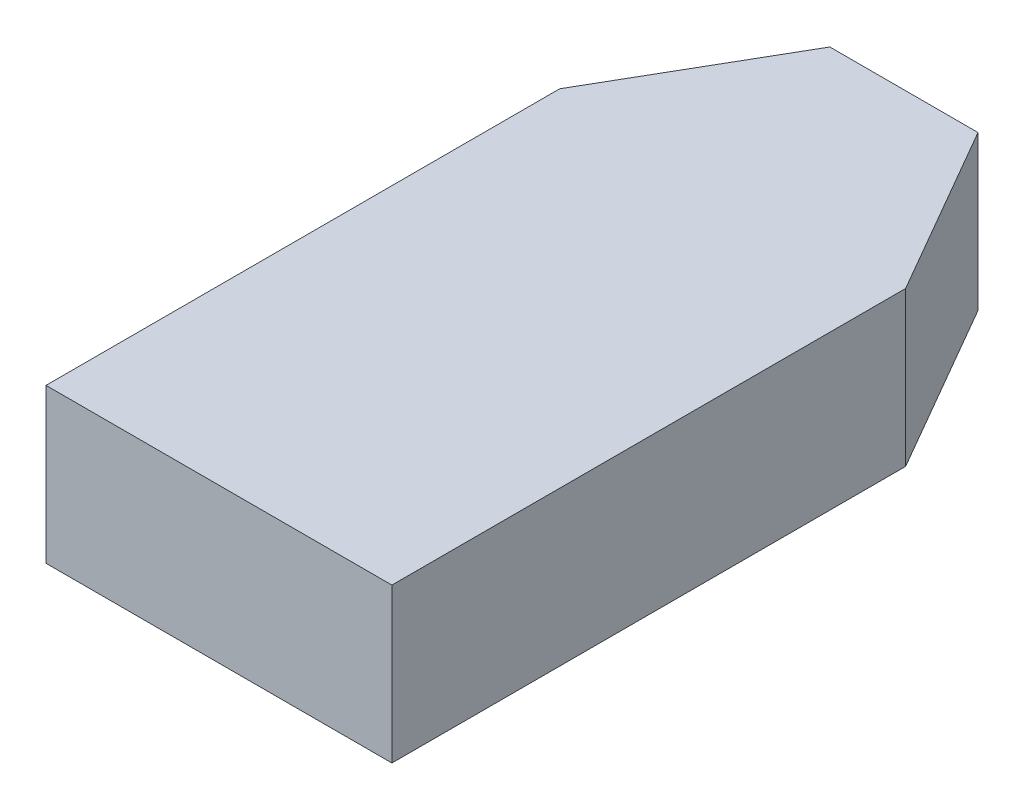
ISO-10303-21;
HEADER;
FILE_DESCRIPTION(('STEP AP214'),'2;1');
FILE_NAME('part.step','',(''),(''),'','','');
FILE_SCHEMA(('AUTOMOTIVE_DESIGN { 1 0 10303 214 1 1 1 1 }'));
ENDSEC;
DATA;
#1=APPLICATION_CONTEXT('core data for automotive mechanical design processes');
#2=APPLICATION_PROTOCOL_DEFINITION('international standard','automotive_design',2000,#1);
#3=PRODUCT_CONTEXT('',#1,'mechanical');
#4=PRODUCT('Part','Part','',(#3));
#5=PRODUCT_RELATED_PRODUCT_CATEGORY('part','',(#4));
#6=PRODUCT_DEFINITION_FORMATION('','',#4);
#7=PRODUCT_DEFINITION_CONTEXT('part definition',#1,'design');
#8=PRODUCT_DEFINITION('design','',#6,#7);
#9=PRODUCT_DEFINITION_SHAPE('','',#8);
#10=(LENGTH_UNIT() NAMED_UNIT(*) SI_UNIT(.MILLI.,.METRE.));
#11=(NAMED_UNIT(*) PLANE_ANGLE_UNIT() SI_UNIT($,.RADIAN.));
#12=(NAMED_UNIT(*) SI_UNIT($,.STERADIAN.) SOLID_ANGLE_UNIT());
#13=UNCERTAINTY_MEASURE_WITH_UNIT(LENGTH_MEASURE(1.E-05),#10,'distance_accuracy_value','');
#14=(GEOMETRIC_REPRESENTATION_CONTEXT(3) GLOBAL_UNCERTAINTY_ASSIGNED_CONTEXT((#13)) GLOBAL_UNIT_ASSIGNED_CONTEXT((#10,
#11,#12)) REPRESENTATION_CONTEXT('',''));
#15=CARTESIAN_POINT('',(0.,0.,0.));
#16=DIRECTION('',(0.,0.,1.));
#17=DIRECTION('',(1.,0.,0.));
#18=AXIS2_PLACEMENT_3D('',#15,#16,#17);
#19=CARTESIAN_POINT('',(20.2,9.,-30.));
#20=DIRECTION('',(-1.,0.,0.));
#21=DIRECTION('',(0.,0.,1.));
#22=AXIS2_PLACEMENT_3D('',#19,#20,#21);
#23=PLANE('',#22);
#24=DIRECTION('',(0.,0.,-1.));
#25=VECTOR('',#24,1.);
#26=CARTESIAN_POINT('',(20.2,0.,-30.));
#27=LINE('',#26,#25);
#28=CARTESIAN_POINT('',(20.2,0.,0.));
#29=VERTEX_POINT('',#28);
#30=CARTESIAN_POINT('',(20.2,0.,-30.));
#31=VERTEX_POINT('',#30);
#32=EDGE_CURVE('E119',#29,#31,#27,.T.);
#33=ORIENTED_EDGE('',*,*,#32,.T.);
#34=DIRECTION('',(0.,-1.,0.));
#35=VECTOR('',#34,1.);
#36=CARTESIAN_POINT('',(20.2,9.,-30.));
#37=LINE('',#36,#35);
#38=CARTESIAN_POINT('',(20.2,9.,-30.));
#39=VERTEX_POINT('',#38);
#40=EDGE_CURVE('E11',#39,#31,#37,.T.);
#41=ORIENTED_EDGE('',*,*,#40,.F.);
#42=DIRECTION('',(0.,0.,-1.));
#43=VECTOR('',#42,1.);
#44=CARTESIAN_POINT('',(20.2,9.,-30.));
#45=LINE('',#44,#43);
#46=CARTESIAN_POINT('',(20.2,9.,0.));
#47=VERTEX_POINT('',#46);
#48=EDGE_CURVE('E129',#47,#39,#45,.T.);
#49=ORIENTED_EDGE('',*,*,#48,.F.);
#50=DIRECTION('',(0.,-1.,0.));
#51=VECTOR('',#50,1.);
#52=CARTESIAN_POINT('',(20.2,9.,0.));
#53=LINE('',#52,#51);
#54=EDGE_CURVE('E115',#47,#29,#53,.T.);
#55=ORIENTED_EDGE('',*,*,#54,.T.);
#56=EDGE_LOOP('',(#33,#41,#49,#55));
#57=FACE_BOUND('',#56,.T.);
#58=ADVANCED_FACE('F35',(#57),#23,.F.);
#59=CARTESIAN_POINT('',(20.2,9.,-30.));
#60=DIRECTION('',(-0.866025403784438,0.,0.500000000000001));
#61=DIRECTION('',(0.500000000000001,0.,0.866025403784438));
#62=AXIS2_PLACEMENT_3D('',#59,#60,#61);
#63=PLANE('',#62);
#64=DIRECTION('',(-0.500000000000001,0.,-0.866025403784438));
#65=VECTOR('',#64,1.);
#66=CARTESIAN_POINT('',(20.2,0.,-30.));
#67=LINE('',#66,#65);
#68=CARTESIAN_POINT('',(14.4264973081037,0.,-40.));
#69=VERTEX_POINT('',#68);
#70=EDGE_CURVE('E122',#31,#69,#67,.T.);
#71=ORIENTED_EDGE('',*,*,#70,.T.);
#72=DIRECTION('',(0.,-1.,0.));
#73=VECTOR('',#72,1.);
#74=CARTESIAN_POINT('',(14.4264973081037,9.,-40.));
#75=LINE('',#74,#73);
#76=CARTESIAN_POINT('',(14.4264973081037,9.,-40.));
#77=VERTEX_POINT('',#76);
#78=EDGE_CURVE('E43',#77,#69,#75,.T.);
#79=ORIENTED_EDGE('',*,*,#78,.F.);
#80=DIRECTION('',(-0.500000000000001,0.,-0.866025403784438));
#81=VECTOR('',#80,1.);
#82=CARTESIAN_POINT('',(20.2,9.,-30.));
#83=LINE('',#82,#81);
#84=EDGE_CURVE('E88',#39,#77,#83,.T.);
#85=ORIENTED_EDGE('',*,*,#84,.F.);
#86=ORIENTED_EDGE('',*,*,#40,.T.);
#87=EDGE_LOOP('',(#71,#79,#85,#86));
#88=FACE_BOUND('',#87,.T.);
#89=ADVANCED_FACE('F153',(#88),#63,.F.);
#90=CARTESIAN_POINT('',(5.77350269189627,9.,-40.));
#91=DIRECTION('',(0.,0.,1.));
#92=DIRECTION('',(1.,0.,0.));
#93=AXIS2_PLACEMENT_3D('',#90,#91,#92);
#94=PLANE('',#93);
#95=DIRECTION('',(-1.,0.,0.));
#96=VECTOR('',#95,1.);
#97=CARTESIAN_POINT('',(5.77350269189627,0.,-40.));
#98=LINE('',#97,#96);
#99=CARTESIAN_POINT('',(5.77350269189627,0.,-40.));
#100=VERTEX_POINT('',#99);
#101=EDGE_CURVE('E124',#69,#100,#98,.T.);
#102=ORIENTED_EDGE('',*,*,#101,.T.);
#103=DIRECTION('',(0.,-1.,0.));
#104=VECTOR('',#103,1.);
#105=CARTESIAN_POINT('',(5.77350269189627,9.,-40.));
#106=LINE('',#105,#104);
#107=CARTESIAN_POINT('',(5.77350269189627,9.,-40.));
#108=VERTEX_POINT('',#107);
#109=EDGE_CURVE('E110',#108,#100,#106,.T.);
#110=ORIENTED_EDGE('',*,*,#109,.F.);
#111=DIRECTION('',(-1.,0.,0.));
#112=VECTOR('',#111,1.);
#113=CARTESIAN_POINT('',(5.77350269189627,9.,-40.));
#114=LINE('',#113,#112);
#115=EDGE_CURVE('E101',#77,#108,#114,.T.);
#116=ORIENTED_EDGE('',*,*,#115,.F.);
#117=ORIENTED_EDGE('',*,*,#78,.T.);
#118=EDGE_LOOP('',(#102,#110,#116,#117));
#119=FACE_BOUND('',#118,.T.);
#120=ADVANCED_FACE('F135',(#119),#94,.F.);
#121=CARTESIAN_POINT('',(0.,9.,-30.));
#122=DIRECTION('',(0.866025403784438,0.,0.500000000000001));
#123=DIRECTION('',(0.500000000000001,0.,-0.866025403784438));
#124=AXIS2_PLACEMENT_3D('',#121,#122,#123);
#125=PLANE('',#124);
#126=DIRECTION('',(-0.500000000000001,0.,0.866025403784438));
#127=VECTOR('',#126,1.);
#128=CARTESIAN_POINT('',(0.,0.,-30.));
#129=LINE('',#128,#127);
#130=CARTESIAN_POINT('',(0.,0.,-30.));
#131=VERTEX_POINT('',#130);
#132=EDGE_CURVE('E109',#100,#131,#129,.T.);
#133=ORIENTED_EDGE('',*,*,#132,.T.);
#134=DIRECTION('',(0.,-1.,0.));
#135=VECTOR('',#134,1.);
#136=CARTESIAN_POINT('',(0.,9.,-30.));
#137=LINE('',#136,#135);
#138=CARTESIAN_POINT('',(0.,9.,-30.));
#139=VERTEX_POINT('',#138);
#140=EDGE_CURVE('E106',#139,#131,#137,.T.);
#141=ORIENTED_EDGE('',*,*,#140,.F.);
#142=DIRECTION('',(-0.500000000000001,0.,0.866025403784438));
#143=VECTOR('',#142,1.);
#144=CARTESIAN_POINT('',(0.,9.,-30.));
#145=LINE('',#144,#143);
#146=EDGE_CURVE('E95',#108,#139,#145,.T.);
#147=ORIENTED_EDGE('',*,*,#146,.F.);
#148=ORIENTED_EDGE('',*,*,#109,.T.);
#149=EDGE_LOOP('',(#133,#141,#147,#148));
#150=FACE_BOUND('',#149,.T.);
#151=ADVANCED_FACE('F107',(#150),#125,.F.);
#152=CARTESIAN_POINT('',(0.,9.,-30.));
#153=DIRECTION('',(1.,0.,0.));
#154=DIRECTION('',(0.,0.,-1.));
#155=AXIS2_PLACEMENT_3D('',#152,#153,#154);
#156=PLANE('',#155);
#157=DIRECTION('',(0.,0.,1.));
#158=VECTOR('',#157,1.);
#159=CARTESIAN_POINT('',(0.,0.,-30.));
#160=LINE('',#159,#158);
#161=CARTESIAN_POINT('',(0.,0.,0.));
#162=VERTEX_POINT('',#161);
#163=EDGE_CURVE('E74',#131,#162,#160,.T.);
#164=ORIENTED_EDGE('',*,*,#163,.T.);
#165=DIRECTION('',(0.,-1.,0.));
#166=VECTOR('',#165,1.);
#167=CARTESIAN_POINT('',(0.,9.,0.));
#168=LINE('',#167,#166);
#169=CARTESIAN_POINT('',(0.,9.,0.));
#170=VERTEX_POINT('',#169);
#171=EDGE_CURVE('E111',#170,#162,#168,.T.);
#172=ORIENTED_EDGE('',*,*,#171,.F.);
#173=DIRECTION('',(0.,0.,1.));
#174=VECTOR('',#173,1.);
#175=CARTESIAN_POINT('',(0.,9.,-30.));
#176=LINE('',#175,#174);
#177=EDGE_CURVE('E99',#139,#170,#176,.T.);
#178=ORIENTED_EDGE('',*,*,#177,.F.);
#179=ORIENTED_EDGE('',*,*,#140,.T.);
#180=EDGE_LOOP('',(#164,#172,#178,#179));
#181=FACE_BOUND('',#180,.T.);
#182=ADVANCED_FACE('F113',(#181),#156,.F.);
#183=CARTESIAN_POINT('',(0.,9.,0.));
#184=DIRECTION('',(0.,0.,-1.));
#185=DIRECTION('',(-1.,0.,0.));
#186=AXIS2_PLACEMENT_3D('',#183,#184,#185);
#187=PLANE('',#186);
#188=DIRECTION('',(1.,0.,0.));
#189=VECTOR('',#188,1.);
#190=CARTESIAN_POINT('',(0.,0.,0.));
#191=LINE('',#190,#189);
#192=EDGE_CURVE('E80',#162,#29,#191,.T.);
#193=ORIENTED_EDGE('',*,*,#192,.T.);
#194=ORIENTED_EDGE('',*,*,#54,.F.);
#195=DIRECTION('',(1.,0.,0.));
#196=VECTOR('',#195,1.);
#197=CARTESIAN_POINT('',(0.,9.,0.));
#198=LINE('',#197,#196);
#199=EDGE_CURVE('E51',#170,#47,#198,.T.);
#200=ORIENTED_EDGE('',*,*,#199,.F.);
#201=ORIENTED_EDGE('',*,*,#171,.T.);
#202=EDGE_LOOP('',(#193,#194,#200,#201));
#203=FACE_BOUND('',#202,.T.);
#204=ADVANCED_FACE('F142',(#203),#187,.F.);
#205=CARTESIAN_POINT('',(0.,9.,0.));
#206=DIRECTION('',(0.,1.,0.));
#207=DIRECTION('',(0.,0.,1.));
#208=AXIS2_PLACEMENT_3D('',#205,#206,#207);
#209=PLANE('',#208);
#210=ORIENTED_EDGE('',*,*,#48,.T.);
#211=ORIENTED_EDGE('',*,*,#84,.T.);
#212=ORIENTED_EDGE('',*,*,#115,.T.);
#213=ORIENTED_EDGE('',*,*,#146,.T.);
#214=ORIENTED_EDGE('',*,*,#177,.T.);
#215=ORIENTED_EDGE('',*,*,#199,.T.);
#216=EDGE_LOOP('',(#210,#211,#212,#213,#214,#215));
#217=FACE_BOUND('',#216,.T.);
#218=ADVANCED_FACE('F97',(#217),#209,.T.);
#219=CARTESIAN_POINT('',(0.,0.,0.));
#220=DIRECTION('',(0.,1.,0.));
#221=DIRECTION('',(0.,0.,1.));
#222=AXIS2_PLACEMENT_3D('',#219,#220,#221);
#223=PLANE('',#222);
#224=ORIENTED_EDGE('',*,*,#32,.F.);
#225=ORIENTED_EDGE('',*,*,#192,.F.);
#226=ORIENTED_EDGE('',*,*,#163,.F.);
#227=ORIENTED_EDGE('',*,*,#132,.F.);
#228=ORIENTED_EDGE('',*,*,#101,.F.);
#229=ORIENTED_EDGE('',*,*,#70,.F.);
#230=EDGE_LOOP('',(#224,#225,#226,#227,#228,#229));
#231=FACE_BOUND('',#230,.T.);
#232=ADVANCED_FACE('F138',(#231),#223,.F.);
#233=CLOSED_SHELL('',(#58,#89,#120,#151,#182,#204,#218,#232));
#234=MANIFOLD_SOLID_BREP('B2',#233);
#235=ADVANCED_BREP_SHAPE_REPRESENTATION('',(#18,#234),#14);
#236=SHAPE_DEFINITION_REPRESENTATION(#9,#235);
ENDSEC;
END-ISO-10303-21;
